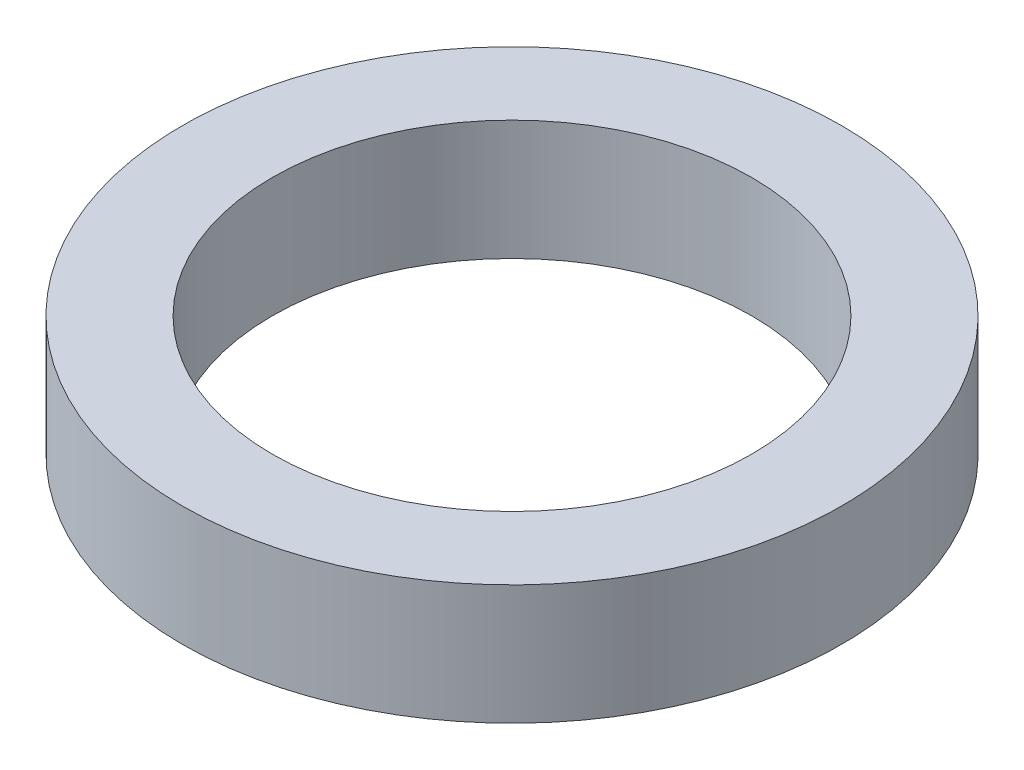
ISO-10303-21;
HEADER;
FILE_DESCRIPTION(('STEP AP214'),'2;1');
FILE_NAME('part.step','',(''),(''),'','','');
FILE_SCHEMA(('AUTOMOTIVE_DESIGN { 1 0 10303 214 1 1 1 1 }'));
ENDSEC;
DATA;
#1=APPLICATION_CONTEXT('core data for automotive mechanical design processes');
#2=APPLICATION_PROTOCOL_DEFINITION('international standard','automotive_design',2000,#1);
#3=PRODUCT_CONTEXT('',#1,'mechanical');
#4=PRODUCT('Part','Part','',(#3));
#5=PRODUCT_RELATED_PRODUCT_CATEGORY('part','',(#4));
#6=PRODUCT_DEFINITION_FORMATION('','',#4);
#7=PRODUCT_DEFINITION_CONTEXT('part definition',#1,'design');
#8=PRODUCT_DEFINITION('design','',#6,#7);
#9=PRODUCT_DEFINITION_SHAPE('','',#8);
#10=(LENGTH_UNIT() NAMED_UNIT(*) SI_UNIT(.MILLI.,.METRE.));
#11=(NAMED_UNIT(*) PLANE_ANGLE_UNIT() SI_UNIT($,.RADIAN.));
#12=(NAMED_UNIT(*) SI_UNIT($,.STERADIAN.) SOLID_ANGLE_UNIT());
#13=UNCERTAINTY_MEASURE_WITH_UNIT(LENGTH_MEASURE(1.E-05),#10,'distance_accuracy_value','');
#14=(GEOMETRIC_REPRESENTATION_CONTEXT(3) GLOBAL_UNCERTAINTY_ASSIGNED_CONTEXT((#13)) GLOBAL_UNIT_ASSIGNED_CONTEXT((#10,
#11,#12)) REPRESENTATION_CONTEXT('',''));
#15=CARTESIAN_POINT('',(0.,0.,0.));
#16=DIRECTION('',(0.,0.,1.));
#17=DIRECTION('',(1.,0.,0.));
#18=AXIS2_PLACEMENT_3D('',#15,#16,#17);
#19=CARTESIAN_POINT('',(0.,10.,0.));
#20=DIRECTION('',(0.,-1.,0.));
#21=DIRECTION('',(0.,0.,-1.));
#22=AXIS2_PLACEMENT_3D('',#19,#20,#21);
#23=CYLINDRICAL_SURFACE('',#22,27.5);
#24=CARTESIAN_POINT('',(0.,10.,0.));
#25=DIRECTION('',(0.,1.,0.));
#26=DIRECTION('',(0.,0.,1.));
#27=AXIS2_PLACEMENT_3D('',#24,#25,#26);
#28=CIRCLE('',#27,27.5);
#29=CARTESIAN_POINT('',(0.,10.,27.5));
#30=VERTEX_POINT('',#29);
#31=EDGE_CURVE('E10',#30,#30,#28,.T.);
#32=ORIENTED_EDGE('',*,*,#31,.F.);
#33=EDGE_LOOP('',(#32));
#34=FACE_BOUND('',#33,.T.);
#35=CARTESIAN_POINT('',(0.,0.,0.));
#36=DIRECTION('',(0.,1.,0.));
#37=DIRECTION('',(0.,0.,1.));
#38=AXIS2_PLACEMENT_3D('',#35,#36,#37);
#39=CIRCLE('',#38,27.5);
#40=CARTESIAN_POINT('',(0.,0.,27.5));
#41=VERTEX_POINT('',#40);
#42=EDGE_CURVE('E37',#41,#41,#39,.T.);
#43=ORIENTED_EDGE('',*,*,#42,.T.);
#44=EDGE_LOOP('',(#43));
#45=FACE_BOUND('',#44,.T.);
#46=ADVANCED_FACE('F40',(#34,#45),#23,.T.);
#47=CARTESIAN_POINT('',(0.,10.,0.));
#48=DIRECTION('',(0.,1.,0.));
#49=DIRECTION('',(0.,0.,1.));
#50=AXIS2_PLACEMENT_3D('',#47,#48,#49);
#51=PLANE('',#50);
#52=CARTESIAN_POINT('',(0.,10.,0.));
#53=DIRECTION('',(0.,1.,0.));
#54=DIRECTION('',(0.,0.,1.));
#55=AXIS2_PLACEMENT_3D('',#52,#53,#54);
#56=CIRCLE('',#55,20.);
#57=CARTESIAN_POINT('',(0.,10.,20.));
#58=VERTEX_POINT('',#57);
#59=EDGE_CURVE('E50',#58,#58,#56,.T.);
#60=ORIENTED_EDGE('',*,*,#59,.F.);
#61=EDGE_LOOP('',(#60));
#62=FACE_BOUND('',#61,.T.);
#63=ORIENTED_EDGE('',*,*,#31,.T.);
#64=EDGE_LOOP('',(#63));
#65=FACE_BOUND('',#64,.T.);
#66=ADVANCED_FACE('F59',(#62,#65),#51,.T.);
#67=CARTESIAN_POINT('',(0.,0.,0.));
#68=DIRECTION('',(0.,1.,0.));
#69=DIRECTION('',(0.,0.,1.));
#70=AXIS2_PLACEMENT_3D('',#67,#68,#69);
#71=PLANE('',#70);
#72=CARTESIAN_POINT('',(0.,0.,0.));
#73=DIRECTION('',(0.,1.,0.));
#74=DIRECTION('',(0.,0.,1.));
#75=AXIS2_PLACEMENT_3D('',#72,#73,#74);
#76=CIRCLE('',#75,20.);
#77=CARTESIAN_POINT('',(0.,0.,20.));
#78=VERTEX_POINT('',#77);
#79=EDGE_CURVE('E47',#78,#78,#76,.T.);
#80=ORIENTED_EDGE('',*,*,#79,.T.);
#81=EDGE_LOOP('',(#80));
#82=FACE_BOUND('',#81,.T.);
#83=ORIENTED_EDGE('',*,*,#42,.F.);
#84=EDGE_LOOP('',(#83));
#85=FACE_BOUND('',#84,.T.);
#86=ADVANCED_FACE('F58',(#82,#85),#71,.F.);
#87=CARTESIAN_POINT('',(0.,10.,0.));
#88=DIRECTION('',(0.,-1.,0.));
#89=DIRECTION('',(0.,0.,-1.));
#90=AXIS2_PLACEMENT_3D('',#87,#88,#89);
#91=CYLINDRICAL_SURFACE('',#90,20.);
#92=ORIENTED_EDGE('',*,*,#59,.T.);
#93=EDGE_LOOP('',(#92));
#94=FACE_BOUND('',#93,.T.);
#95=ORIENTED_EDGE('',*,*,#79,.F.);
#96=EDGE_LOOP('',(#95));
#97=FACE_BOUND('',#96,.T.);
#98=ADVANCED_FACE('F54',(#94,#97),#91,.F.);
#99=CLOSED_SHELL('',(#46,#66,#86,#98));
#100=MANIFOLD_SOLID_BREP('B2',#99);
#101=ADVANCED_BREP_SHAPE_REPRESENTATION('',(#18,#100),#14);
#102=SHAPE_DEFINITION_REPRESENTATION(#9,#101);
ENDSEC;
END-ISO-10303-21;
